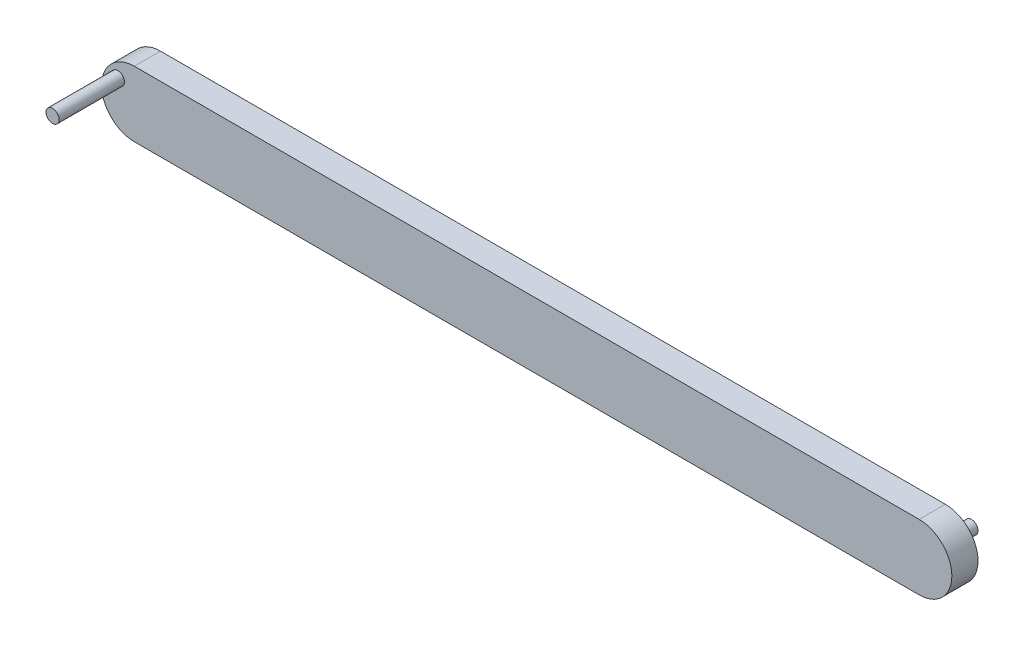
ISO-10303-21;
HEADER;
FILE_DESCRIPTION(('STEP AP214'),'2;1');
FILE_NAME('part.step','',(''),(''),'','','');
FILE_SCHEMA(('AUTOMOTIVE_DESIGN { 1 0 10303 214 1 1 1 1 }'));
ENDSEC;
DATA;
#1=APPLICATION_CONTEXT('core data for automotive mechanical design processes');
#2=APPLICATION_PROTOCOL_DEFINITION('international standard','automotive_design',2000,#1);
#3=PRODUCT_CONTEXT('',#1,'mechanical');
#4=PRODUCT('Part','Part','',(#3));
#5=PRODUCT_RELATED_PRODUCT_CATEGORY('part','',(#4));
#6=PRODUCT_DEFINITION_FORMATION('','',#4);
#7=PRODUCT_DEFINITION_CONTEXT('part definition',#1,'design');
#8=PRODUCT_DEFINITION('design','',#6,#7);
#9=PRODUCT_DEFINITION_SHAPE('','',#8);
#10=(LENGTH_UNIT() NAMED_UNIT(*) SI_UNIT(.MILLI.,.METRE.));
#11=(NAMED_UNIT(*) PLANE_ANGLE_UNIT() SI_UNIT($,.RADIAN.));
#12=(NAMED_UNIT(*) SI_UNIT($,.STERADIAN.) SOLID_ANGLE_UNIT());
#13=UNCERTAINTY_MEASURE_WITH_UNIT(LENGTH_MEASURE(1.E-05),#10,'distance_accuracy_value','');
#14=(GEOMETRIC_REPRESENTATION_CONTEXT(3) GLOBAL_UNCERTAINTY_ASSIGNED_CONTEXT((#13)) GLOBAL_UNIT_ASSIGNED_CONTEXT((#10,
#11,#12)) REPRESENTATION_CONTEXT('',''));
#15=CARTESIAN_POINT('',(0.,0.,0.));
#16=DIRECTION('',(0.,0.,1.));
#17=DIRECTION('',(1.,0.,0.));
#18=AXIS2_PLACEMENT_3D('',#15,#16,#17);
#19=CARTESIAN_POINT('',(-30.,-2.5,2.));
#20=DIRECTION('',(0.,0.,-1.));
#21=DIRECTION('',(-1.,0.,0.));
#22=AXIS2_PLACEMENT_3D('',#19,#20,#21);
#23=CYLINDRICAL_SURFACE('',#22,2.5);
#24=CARTESIAN_POINT('',(-30.,-2.5,0.));
#25=DIRECTION('',(0.,0.,1.));
#26=DIRECTION('',(1.,0.,0.));
#27=AXIS2_PLACEMENT_3D('',#24,#25,#26);
#28=CIRCLE('',#27,2.5);
#29=CARTESIAN_POINT('',(-30.,0.,0.));
#30=VERTEX_POINT('',#29);
#31=CARTESIAN_POINT('',(-30.,-5.,0.));
#32=VERTEX_POINT('',#31);
#33=EDGE_CURVE('E114',#30,#32,#28,.T.);
#34=ORIENTED_EDGE('',*,*,#33,.T.);
#35=DIRECTION('',(0.,0.,-1.));
#36=VECTOR('',#35,1.);
#37=CARTESIAN_POINT('',(-30.,-5.,2.));
#38=LINE('',#37,#36);
#39=CARTESIAN_POINT('',(-30.,-5.,2.));
#40=VERTEX_POINT('',#39);
#41=EDGE_CURVE('E50',#40,#32,#38,.T.);
#42=ORIENTED_EDGE('',*,*,#41,.F.);
#43=CARTESIAN_POINT('',(-30.,-2.5,2.));
#44=DIRECTION('',(0.,0.,1.));
#45=DIRECTION('',(1.,0.,0.));
#46=AXIS2_PLACEMENT_3D('',#43,#44,#45);
#47=CIRCLE('',#46,2.5);
#48=CARTESIAN_POINT('',(-30.,0.,2.));
#49=VERTEX_POINT('',#48);
#50=EDGE_CURVE('E94',#49,#40,#47,.T.);
#51=ORIENTED_EDGE('',*,*,#50,.F.);
#52=DIRECTION('',(0.,0.,-1.));
#53=VECTOR('',#52,1.);
#54=CARTESIAN_POINT('',(-30.,0.,2.));
#55=LINE('',#54,#53);
#56=EDGE_CURVE('E110',#49,#30,#55,.T.);
#57=ORIENTED_EDGE('',*,*,#56,.T.);
#58=EDGE_LOOP('',(#34,#42,#51,#57));
#59=FACE_BOUND('',#58,.T.);
#60=ADVANCED_FACE('F41',(#59),#23,.T.);
#61=CARTESIAN_POINT('',(-30.,-5.,2.));
#62=DIRECTION('',(0.,1.,0.));
#63=DIRECTION('',(0.,0.,1.));
#64=AXIS2_PLACEMENT_3D('',#61,#62,#63);
#65=PLANE('',#64);
#66=DIRECTION('',(1.,0.,0.));
#67=VECTOR('',#66,1.);
#68=CARTESIAN_POINT('',(-30.,-5.,0.));
#69=LINE('',#68,#67);
#70=CARTESIAN_POINT('',(30.,-5.,0.));
#71=VERTEX_POINT('',#70);
#72=EDGE_CURVE('E100',#32,#71,#69,.T.);
#73=ORIENTED_EDGE('',*,*,#72,.T.);
#74=DIRECTION('',(0.,0.,-1.));
#75=VECTOR('',#74,1.);
#76=CARTESIAN_POINT('',(30.,-5.,2.));
#77=LINE('',#76,#75);
#78=CARTESIAN_POINT('',(30.,-5.,2.));
#79=VERTEX_POINT('',#78);
#80=EDGE_CURVE('E98',#79,#71,#77,.T.);
#81=ORIENTED_EDGE('',*,*,#80,.F.);
#82=DIRECTION('',(1.,0.,0.));
#83=VECTOR('',#82,1.);
#84=CARTESIAN_POINT('',(-30.,-5.,2.));
#85=LINE('',#84,#83);
#86=EDGE_CURVE('E89',#40,#79,#85,.T.);
#87=ORIENTED_EDGE('',*,*,#86,.F.);
#88=ORIENTED_EDGE('',*,*,#41,.T.);
#89=EDGE_LOOP('',(#73,#81,#87,#88));
#90=FACE_BOUND('',#89,.T.);
#91=ADVANCED_FACE('F99',(#90),#65,.F.);
#92=CARTESIAN_POINT('',(30.,-2.5,2.));
#93=DIRECTION('',(0.,0.,-1.));
#94=DIRECTION('',(-1.,0.,0.));
#95=AXIS2_PLACEMENT_3D('',#92,#93,#94);
#96=CYLINDRICAL_SURFACE('',#95,2.5);
#97=CARTESIAN_POINT('',(30.,-2.5,0.));
#98=DIRECTION('',(0.,0.,1.));
#99=DIRECTION('',(1.,0.,0.));
#100=AXIS2_PLACEMENT_3D('',#97,#98,#99);
#101=CIRCLE('',#100,2.5);
#102=CARTESIAN_POINT('',(30.,0.,0.));
#103=VERTEX_POINT('',#102);
#104=EDGE_CURVE('E75',#71,#103,#101,.T.);
#105=ORIENTED_EDGE('',*,*,#104,.T.);
#106=DIRECTION('',(0.,0.,-1.));
#107=VECTOR('',#106,1.);
#108=CARTESIAN_POINT('',(30.,0.,2.));
#109=LINE('',#108,#107);
#110=CARTESIAN_POINT('',(30.,0.,2.));
#111=VERTEX_POINT('',#110);
#112=EDGE_CURVE('E102',#111,#103,#109,.T.);
#113=ORIENTED_EDGE('',*,*,#112,.F.);
#114=CARTESIAN_POINT('',(30.,-2.5,2.));
#115=DIRECTION('',(0.,0.,1.));
#116=DIRECTION('',(1.,0.,0.));
#117=AXIS2_PLACEMENT_3D('',#114,#115,#116);
#118=CIRCLE('',#117,2.5);
#119=EDGE_CURVE('E92',#79,#111,#118,.T.);
#120=ORIENTED_EDGE('',*,*,#119,.F.);
#121=ORIENTED_EDGE('',*,*,#80,.T.);
#122=EDGE_LOOP('',(#105,#113,#120,#121));
#123=FACE_BOUND('',#122,.T.);
#124=ADVANCED_FACE('F104',(#123),#96,.T.);
#125=CARTESIAN_POINT('',(-30.,0.,2.));
#126=DIRECTION('',(0.,-1.,0.));
#127=DIRECTION('',(0.,0.,-1.));
#128=AXIS2_PLACEMENT_3D('',#125,#126,#127);
#129=PLANE('',#128);
#130=DIRECTION('',(-1.,0.,0.));
#131=VECTOR('',#130,1.);
#132=CARTESIAN_POINT('',(-30.,0.,0.));
#133=LINE('',#132,#131);
#134=EDGE_CURVE('E81',#103,#30,#133,.T.);
#135=ORIENTED_EDGE('',*,*,#134,.T.);
#136=ORIENTED_EDGE('',*,*,#56,.F.);
#137=DIRECTION('',(-1.,0.,0.));
#138=VECTOR('',#137,1.);
#139=CARTESIAN_POINT('',(-30.,0.,2.));
#140=LINE('',#139,#138);
#141=EDGE_CURVE('E58',#111,#49,#140,.T.);
#142=ORIENTED_EDGE('',*,*,#141,.F.);
#143=ORIENTED_EDGE('',*,*,#112,.T.);
#144=EDGE_LOOP('',(#135,#136,#142,#143));
#145=FACE_BOUND('',#144,.T.);
#146=ADVANCED_FACE('F145',(#145),#129,.F.);
#147=CARTESIAN_POINT('',(-30.,-2.5,2.));
#148=DIRECTION('',(0.,0.,1.));
#149=DIRECTION('',(1.,0.,0.));
#150=AXIS2_PLACEMENT_3D('',#147,#148,#149);
#151=PLANE('',#150);
#152=CARTESIAN_POINT('',(-31.2513898266279,-1.41369343058768,2.));
#153=DIRECTION('',(0.,0.,1.));
#154=DIRECTION('',(1.,0.,0.));
#155=AXIS2_PLACEMENT_3D('',#152,#153,#154);
#156=CIRCLE('',#155,0.499999999999999);
#157=CARTESIAN_POINT('',(-30.7513898266279,-1.41369343058768,2.));
#158=VERTEX_POINT('',#157);
#159=EDGE_CURVE('E237',#158,#158,#156,.T.);
#160=ORIENTED_EDGE('',*,*,#159,.F.);
#161=EDGE_LOOP('',(#160));
#162=FACE_BOUND('',#161,.T.);
#163=ORIENTED_EDGE('',*,*,#50,.T.);
#164=ORIENTED_EDGE('',*,*,#86,.T.);
#165=ORIENTED_EDGE('',*,*,#119,.T.);
#166=ORIENTED_EDGE('',*,*,#141,.T.);
#167=EDGE_LOOP('',(#163,#164,#165,#166));
#168=FACE_BOUND('',#167,.T.);
#169=ADVANCED_FACE('F90',(#162,#168),#151,.T.);
#170=CARTESIAN_POINT('',(-30.,-2.5,0.));
#171=DIRECTION('',(0.,0.,1.));
#172=DIRECTION('',(1.,0.,0.));
#173=AXIS2_PLACEMENT_3D('',#170,#171,#172);
#174=PLANE('',#173);
#175=CARTESIAN_POINT('',(30.,-2.5,0.));
#176=DIRECTION('',(0.,0.,1.));
#177=DIRECTION('',(1.,0.,0.));
#178=AXIS2_PLACEMENT_3D('',#175,#176,#177);
#179=CIRCLE('',#178,0.499999999999999);
#180=CARTESIAN_POINT('',(30.5,-2.5,0.));
#181=VERTEX_POINT('',#180);
#182=EDGE_CURVE('E11',#181,#181,#179,.F.);
#183=ORIENTED_EDGE('',*,*,#182,.F.);
#184=EDGE_LOOP('',(#183));
#185=FACE_BOUND('',#184,.T.);
#186=ORIENTED_EDGE('',*,*,#33,.F.);
#187=ORIENTED_EDGE('',*,*,#134,.F.);
#188=ORIENTED_EDGE('',*,*,#104,.F.);
#189=ORIENTED_EDGE('',*,*,#72,.F.);
#190=EDGE_LOOP('',(#186,#187,#188,#189));
#191=FACE_BOUND('',#190,.T.);
#192=ADVANCED_FACE('F133',(#185,#191),#174,.F.);
#193=CARTESIAN_POINT('',(30.,-2.5,-2.));
#194=DIRECTION('',(0.,0.,1.));
#195=DIRECTION('',(1.,0.,0.));
#196=AXIS2_PLACEMENT_3D('',#193,#194,#195);
#197=CYLINDRICAL_SURFACE('',#196,0.499999999999999);
#198=CARTESIAN_POINT('',(30.,-2.5,-2.));
#199=DIRECTION('',(0.,0.,-1.));
#200=DIRECTION('',(-1.,0.,0.));
#201=AXIS2_PLACEMENT_3D('',#198,#199,#200);
#202=CIRCLE('',#201,0.499999999999999);
#203=CARTESIAN_POINT('',(29.5,-2.5,-2.));
#204=VERTEX_POINT('',#203);
#205=EDGE_CURVE('E118',#204,#204,#202,.T.);
#206=ORIENTED_EDGE('',*,*,#205,.F.);
#207=EDGE_LOOP('',(#206));
#208=FACE_BOUND('',#207,.T.);
#209=ORIENTED_EDGE('',*,*,#182,.T.);
#210=EDGE_LOOP('',(#209));
#211=FACE_BOUND('',#210,.T.);
#212=ADVANCED_FACE('F135',(#208,#211),#197,.T.);
#213=CARTESIAN_POINT('',(30.,-2.5,-2.));
#214=DIRECTION('',(0.,0.,-1.));
#215=DIRECTION('',(-1.,0.,0.));
#216=AXIS2_PLACEMENT_3D('',#213,#214,#215);
#217=PLANE('',#216);
#218=ORIENTED_EDGE('',*,*,#205,.T.);
#219=EDGE_LOOP('',(#218));
#220=FACE_BOUND('',#219,.T.);
#221=ADVANCED_FACE('F142',(#220),#217,.T.);
#222=CARTESIAN_POINT('',(-31.2513898266279,-1.41369343058768,7.));
#223=DIRECTION('',(0.,0.,-1.));
#224=DIRECTION('',(-1.,0.,0.));
#225=AXIS2_PLACEMENT_3D('',#222,#223,#224);
#226=CYLINDRICAL_SURFACE('',#225,0.499999999999999);
#227=CARTESIAN_POINT('',(-31.2513898266279,-1.41369343058768,7.));
#228=DIRECTION('',(0.,0.,1.));
#229=DIRECTION('',(1.,0.,0.));
#230=AXIS2_PLACEMENT_3D('',#227,#228,#229);
#231=CIRCLE('',#230,0.499999999999999);
#232=CARTESIAN_POINT('',(-30.7513898266279,-1.41369343058768,7.));
#233=VERTEX_POINT('',#232);
#234=EDGE_CURVE('E236',#233,#233,#231,.T.);
#235=ORIENTED_EDGE('',*,*,#234,.F.);
#236=EDGE_LOOP('',(#235));
#237=FACE_BOUND('',#236,.T.);
#238=ORIENTED_EDGE('',*,*,#159,.T.);
#239=EDGE_LOOP('',(#238));
#240=FACE_BOUND('',#239,.T.);
#241=ADVANCED_FACE('F182',(#237,#240),#226,.T.);
#242=CARTESIAN_POINT('',(-31.2513898266279,-1.41369343058768,7.));
#243=DIRECTION('',(0.,0.,1.));
#244=DIRECTION('',(1.,0.,0.));
#245=AXIS2_PLACEMENT_3D('',#242,#243,#244);
#246=PLANE('',#245);
#247=ORIENTED_EDGE('',*,*,#234,.T.);
#248=EDGE_LOOP('',(#247));
#249=FACE_BOUND('',#248,.T.);
#250=ADVANCED_FACE('F190',(#249),#246,.T.);
#251=CLOSED_SHELL('',(#60,#91,#124,#146,#169,#192,#212,#221,#241,#250));
#252=MANIFOLD_SOLID_BREP('B2',#251);
#253=ADVANCED_BREP_SHAPE_REPRESENTATION('',(#18,#252),#14);
#254=SHAPE_DEFINITION_REPRESENTATION(#9,#253);
ENDSEC;
END-ISO-10303-21;
